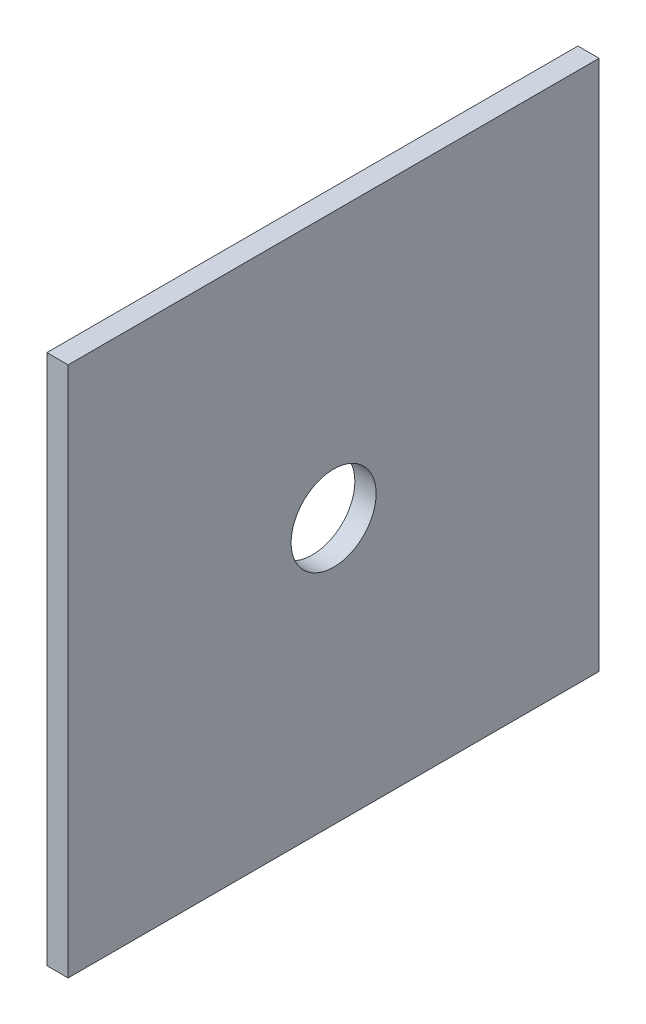
ISO-10303-21;
HEADER;
FILE_DESCRIPTION(('STEP AP214'),'2;1');
FILE_NAME('part.step','',(''),(''),'','','');
FILE_SCHEMA(('AUTOMOTIVE_DESIGN { 1 0 10303 214 1 1 1 1 }'));
ENDSEC;
DATA;
#1=APPLICATION_CONTEXT('core data for automotive mechanical design processes');
#2=APPLICATION_PROTOCOL_DEFINITION('international standard','automotive_design',2000,#1);
#3=PRODUCT_CONTEXT('',#1,'mechanical');
#4=PRODUCT('Part','Part','',(#3));
#5=PRODUCT_RELATED_PRODUCT_CATEGORY('part','',(#4));
#6=PRODUCT_DEFINITION_FORMATION('','',#4);
#7=PRODUCT_DEFINITION_CONTEXT('part definition',#1,'design');
#8=PRODUCT_DEFINITION('design','',#6,#7);
#9=PRODUCT_DEFINITION_SHAPE('','',#8);
#10=(LENGTH_UNIT() NAMED_UNIT(*) SI_UNIT(.MILLI.,.METRE.));
#11=(NAMED_UNIT(*) PLANE_ANGLE_UNIT() SI_UNIT($,.RADIAN.));
#12=(NAMED_UNIT(*) SI_UNIT($,.STERADIAN.) SOLID_ANGLE_UNIT());
#13=UNCERTAINTY_MEASURE_WITH_UNIT(LENGTH_MEASURE(1.E-05),#10,'distance_accuracy_value','');
#14=(GEOMETRIC_REPRESENTATION_CONTEXT(3) GLOBAL_UNCERTAINTY_ASSIGNED_CONTEXT((#13)) GLOBAL_UNIT_ASSIGNED_CONTEXT((#10,
#11,#12)) REPRESENTATION_CONTEXT('',''));
#15=CARTESIAN_POINT('',(0.,0.,0.));
#16=DIRECTION('',(0.,0.,1.));
#17=DIRECTION('',(1.,0.,0.));
#18=AXIS2_PLACEMENT_3D('',#15,#16,#17);
#19=CARTESIAN_POINT('',(2.,0.,0.));
#20=DIRECTION('',(-1.,0.,0.));
#21=DIRECTION('',(0.,0.,1.));
#22=AXIS2_PLACEMENT_3D('',#19,#20,#21);
#23=PLANE('',#22);
#24=DIRECTION('',(0.,1.,0.));
#25=VECTOR('',#24,1.);
#26=CARTESIAN_POINT('',(2.,-50.,-50.));
#27=LINE('',#26,#25);
#28=CARTESIAN_POINT('',(2.,-50.,-50.));
#29=VERTEX_POINT('',#28);
#30=CARTESIAN_POINT('',(2.,50.,-50.));
#31=VERTEX_POINT('',#30);
#32=EDGE_CURVE('E85',#29,#31,#27,.T.);
#33=ORIENTED_EDGE('',*,*,#32,.T.);
#34=DIRECTION('',(0.,0.,1.));
#35=VECTOR('',#34,1.);
#36=CARTESIAN_POINT('',(2.,50.,50.));
#37=LINE('',#36,#35);
#38=CARTESIAN_POINT('',(2.,50.,50.));
#39=VERTEX_POINT('',#38);
#40=EDGE_CURVE('E80',#31,#39,#37,.T.);
#41=ORIENTED_EDGE('',*,*,#40,.T.);
#42=DIRECTION('',(0.,-1.,0.));
#43=VECTOR('',#42,1.);
#44=CARTESIAN_POINT('',(2.,-50.,50.));
#45=LINE('',#44,#43);
#46=CARTESIAN_POINT('',(2.,-50.,50.));
#47=VERTEX_POINT('',#46);
#48=EDGE_CURVE('E83',#39,#47,#45,.T.);
#49=ORIENTED_EDGE('',*,*,#48,.T.);
#50=DIRECTION('',(0.,0.,-1.));
#51=VECTOR('',#50,1.);
#52=CARTESIAN_POINT('',(2.,-50.,50.));
#53=LINE('',#52,#51);
#54=EDGE_CURVE('E50',#47,#29,#53,.T.);
#55=ORIENTED_EDGE('',*,*,#54,.T.);
#56=EDGE_LOOP('',(#33,#41,#49,#55));
#57=FACE_BOUND('',#56,.T.);
#58=CARTESIAN_POINT('',(2.,0.,0.));
#59=DIRECTION('',(1.,0.,0.));
#60=DIRECTION('',(0.,0.,-1.));
#61=AXIS2_PLACEMENT_3D('',#58,#59,#60);
#62=CIRCLE('',#61,8.);
#63=CARTESIAN_POINT('',(2.,0.,-8.));
#64=VERTEX_POINT('',#63);
#65=EDGE_CURVE('E100',#64,#64,#62,.T.);
#66=ORIENTED_EDGE('',*,*,#65,.F.);
#67=EDGE_LOOP('',(#66));
#68=FACE_BOUND('',#67,.T.);
#69=ADVANCED_FACE('F33',(#57,#68),#23,.F.);
#70=CARTESIAN_POINT('',(-2.,0.,0.));
#71=DIRECTION('',(-1.,0.,0.));
#72=DIRECTION('',(0.,0.,1.));
#73=AXIS2_PLACEMENT_3D('',#70,#71,#72);
#74=PLANE('',#73);
#75=DIRECTION('',(0.,1.,0.));
#76=VECTOR('',#75,1.);
#77=CARTESIAN_POINT('',(-2.,-50.,-50.));
#78=LINE('',#77,#76);
#79=CARTESIAN_POINT('',(-2.,-50.,-50.));
#80=VERTEX_POINT('',#79);
#81=CARTESIAN_POINT('',(-2.,50.,-50.));
#82=VERTEX_POINT('',#81);
#83=EDGE_CURVE('E97',#80,#82,#78,.T.);
#84=ORIENTED_EDGE('',*,*,#83,.F.);
#85=DIRECTION('',(0.,0.,-1.));
#86=VECTOR('',#85,1.);
#87=CARTESIAN_POINT('',(-2.,-50.,50.));
#88=LINE('',#87,#86);
#89=CARTESIAN_POINT('',(-2.,-50.,50.));
#90=VERTEX_POINT('',#89);
#91=EDGE_CURVE('E73',#90,#80,#88,.T.);
#92=ORIENTED_EDGE('',*,*,#91,.F.);
#93=DIRECTION('',(0.,-1.,0.));
#94=VECTOR('',#93,1.);
#95=CARTESIAN_POINT('',(-2.,-50.,50.));
#96=LINE('',#95,#94);
#97=CARTESIAN_POINT('',(-2.,50.,50.));
#98=VERTEX_POINT('',#97);
#99=EDGE_CURVE('E67',#98,#90,#96,.T.);
#100=ORIENTED_EDGE('',*,*,#99,.F.);
#101=DIRECTION('',(0.,0.,1.));
#102=VECTOR('',#101,1.);
#103=CARTESIAN_POINT('',(-2.,50.,50.));
#104=LINE('',#103,#102);
#105=EDGE_CURVE('E89',#82,#98,#104,.T.);
#106=ORIENTED_EDGE('',*,*,#105,.F.);
#107=EDGE_LOOP('',(#84,#92,#100,#106));
#108=FACE_BOUND('',#107,.T.);
#109=CARTESIAN_POINT('',(-2.,0.,0.));
#110=DIRECTION('',(1.,0.,0.));
#111=DIRECTION('',(0.,0.,-1.));
#112=AXIS2_PLACEMENT_3D('',#109,#110,#111);
#113=CIRCLE('',#112,8.);
#114=CARTESIAN_POINT('',(-2.,0.,-8.));
#115=VERTEX_POINT('',#114);
#116=EDGE_CURVE('E112',#115,#115,#113,.T.);
#117=ORIENTED_EDGE('',*,*,#116,.T.);
#118=EDGE_LOOP('',(#117));
#119=FACE_BOUND('',#118,.T.);
#120=ADVANCED_FACE('F108',(#108,#119),#74,.T.);
#121=CARTESIAN_POINT('',(2.,-50.,-50.));
#122=DIRECTION('',(0.,0.,1.));
#123=DIRECTION('',(1.,0.,0.));
#124=AXIS2_PLACEMENT_3D('',#121,#122,#123);
#125=PLANE('',#124);
#126=ORIENTED_EDGE('',*,*,#83,.T.);
#127=DIRECTION('',(-1.,0.,0.));
#128=VECTOR('',#127,1.);
#129=CARTESIAN_POINT('',(2.,50.,-50.));
#130=LINE('',#129,#128);
#131=EDGE_CURVE('E11',#31,#82,#130,.T.);
#132=ORIENTED_EDGE('',*,*,#131,.F.);
#133=ORIENTED_EDGE('',*,*,#32,.F.);
#134=DIRECTION('',(-1.,0.,0.));
#135=VECTOR('',#134,1.);
#136=CARTESIAN_POINT('',(2.,-50.,-50.));
#137=LINE('',#136,#135);
#138=EDGE_CURVE('E93',#29,#80,#137,.T.);
#139=ORIENTED_EDGE('',*,*,#138,.T.);
#140=EDGE_LOOP('',(#126,#132,#133,#139));
#141=FACE_BOUND('',#140,.T.);
#142=ADVANCED_FACE('F35',(#141),#125,.F.);
#143=CARTESIAN_POINT('',(2.,50.,50.));
#144=DIRECTION('',(0.,-1.,0.));
#145=DIRECTION('',(0.,0.,-1.));
#146=AXIS2_PLACEMENT_3D('',#143,#144,#145);
#147=PLANE('',#146);
#148=ORIENTED_EDGE('',*,*,#105,.T.);
#149=DIRECTION('',(-1.,0.,0.));
#150=VECTOR('',#149,1.);
#151=CARTESIAN_POINT('',(2.,50.,50.));
#152=LINE('',#151,#150);
#153=EDGE_CURVE('E42',#39,#98,#152,.T.);
#154=ORIENTED_EDGE('',*,*,#153,.F.);
#155=ORIENTED_EDGE('',*,*,#40,.F.);
#156=ORIENTED_EDGE('',*,*,#131,.T.);
#157=EDGE_LOOP('',(#148,#154,#155,#156));
#158=FACE_BOUND('',#157,.T.);
#159=ADVANCED_FACE('F88',(#158),#147,.F.);
#160=CARTESIAN_POINT('',(2.,-50.,50.));
#161=DIRECTION('',(0.,0.,-1.));
#162=DIRECTION('',(-1.,0.,0.));
#163=AXIS2_PLACEMENT_3D('',#160,#161,#162);
#164=PLANE('',#163);
#165=ORIENTED_EDGE('',*,*,#99,.T.);
#166=DIRECTION('',(-1.,0.,0.));
#167=VECTOR('',#166,1.);
#168=CARTESIAN_POINT('',(2.,-50.,50.));
#169=LINE('',#168,#167);
#170=EDGE_CURVE('E90',#47,#90,#169,.T.);
#171=ORIENTED_EDGE('',*,*,#170,.F.);
#172=ORIENTED_EDGE('',*,*,#48,.F.);
#173=ORIENTED_EDGE('',*,*,#153,.T.);
#174=EDGE_LOOP('',(#165,#171,#172,#173));
#175=FACE_BOUND('',#174,.T.);
#176=ADVANCED_FACE('F91',(#175),#164,.F.);
#177=CARTESIAN_POINT('',(2.,-50.,50.));
#178=DIRECTION('',(0.,1.,0.));
#179=DIRECTION('',(0.,0.,1.));
#180=AXIS2_PLACEMENT_3D('',#177,#178,#179);
#181=PLANE('',#180);
#182=ORIENTED_EDGE('',*,*,#91,.T.);
#183=ORIENTED_EDGE('',*,*,#138,.F.);
#184=ORIENTED_EDGE('',*,*,#54,.F.);
#185=ORIENTED_EDGE('',*,*,#170,.T.);
#186=EDGE_LOOP('',(#182,#183,#184,#185));
#187=FACE_BOUND('',#186,.T.);
#188=ADVANCED_FACE('F105',(#187),#181,.F.);
#189=CARTESIAN_POINT('',(2.,0.,0.));
#190=DIRECTION('',(-1.,0.,0.));
#191=DIRECTION('',(0.,0.,1.));
#192=AXIS2_PLACEMENT_3D('',#189,#190,#191);
#193=CYLINDRICAL_SURFACE('',#192,8.);
#194=ORIENTED_EDGE('',*,*,#65,.T.);
#195=EDGE_LOOP('',(#194));
#196=FACE_BOUND('',#195,.T.);
#197=ORIENTED_EDGE('',*,*,#116,.F.);
#198=EDGE_LOOP('',(#197));
#199=FACE_BOUND('',#198,.T.);
#200=ADVANCED_FACE('F118',(#196,#199),#193,.F.);
#201=CLOSED_SHELL('',(#69,#120,#142,#159,#176,#188,#200));
#202=MANIFOLD_SOLID_BREP('B2',#201);
#203=ADVANCED_BREP_SHAPE_REPRESENTATION('',(#18,#202),#14);
#204=SHAPE_DEFINITION_REPRESENTATION(#9,#203);
ENDSEC;
END-ISO-10303-21;
